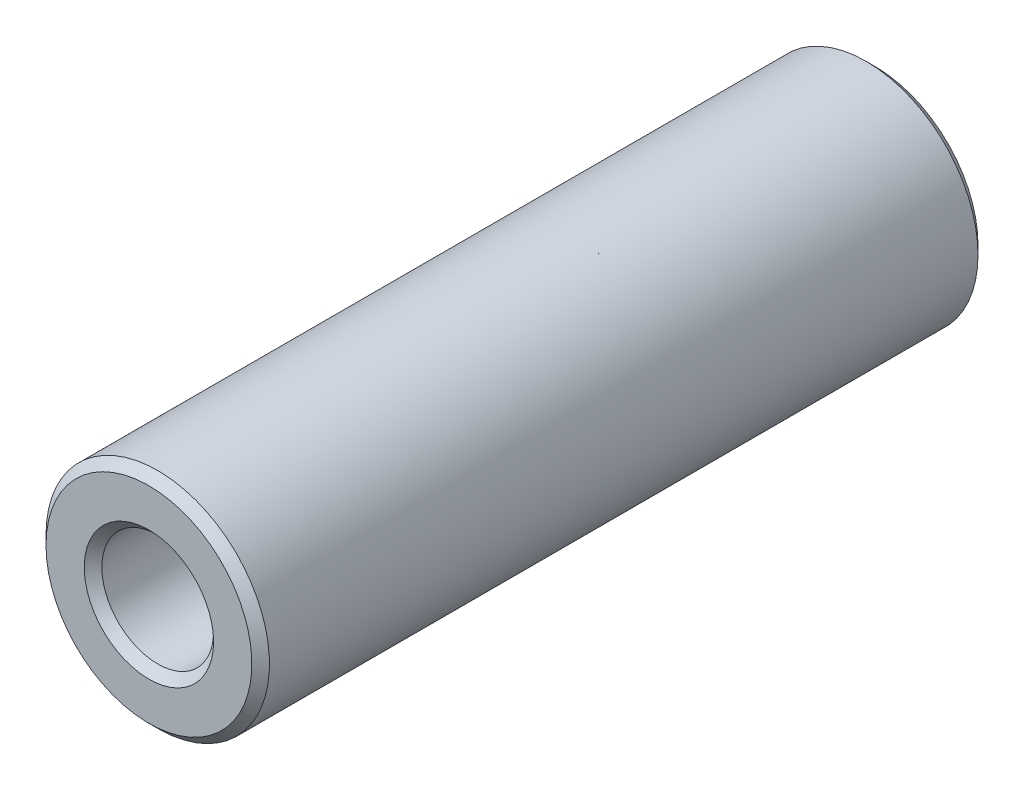
ISO-10303-21;
HEADER;
FILE_DESCRIPTION(('STEP AP214'),'2;1');
FILE_NAME('part.step','',(''),(''),'','','');
FILE_SCHEMA(('AUTOMOTIVE_DESIGN { 1 0 10303 214 1 1 1 1 }'));
ENDSEC;
DATA;
#1=APPLICATION_CONTEXT('core data for automotive mechanical design processes');
#2=APPLICATION_PROTOCOL_DEFINITION('international standard','automotive_design',2000,#1);
#3=PRODUCT_CONTEXT('',#1,'mechanical');
#4=PRODUCT('Part','Part','',(#3));
#5=PRODUCT_RELATED_PRODUCT_CATEGORY('part','',(#4));
#6=PRODUCT_DEFINITION_FORMATION('','',#4);
#7=PRODUCT_DEFINITION_CONTEXT('part definition',#1,'design');
#8=PRODUCT_DEFINITION('design','',#6,#7);
#9=PRODUCT_DEFINITION_SHAPE('','',#8);
#10=(LENGTH_UNIT() NAMED_UNIT(*) SI_UNIT(.MILLI.,.METRE.));
#11=(NAMED_UNIT(*) PLANE_ANGLE_UNIT() SI_UNIT($,.RADIAN.));
#12=(NAMED_UNIT(*) SI_UNIT($,.STERADIAN.) SOLID_ANGLE_UNIT());
#13=UNCERTAINTY_MEASURE_WITH_UNIT(LENGTH_MEASURE(1.E-05),#10,'distance_accuracy_value','');
#14=(GEOMETRIC_REPRESENTATION_CONTEXT(3) GLOBAL_UNCERTAINTY_ASSIGNED_CONTEXT((#13)) GLOBAL_UNIT_ASSIGNED_CONTEXT((#10,
#11,#12)) REPRESENTATION_CONTEXT('',''));
#15=CARTESIAN_POINT('',(0.,0.,0.));
#16=DIRECTION('',(0.,0.,1.));
#17=DIRECTION('',(1.,0.,0.));
#18=AXIS2_PLACEMENT_3D('',#15,#16,#17);
#19=CARTESIAN_POINT('',(0.,0.,41.275));
#20=DIRECTION('',(0.,0.,-1.));
#21=DIRECTION('',(-1.,0.,0.));
#22=AXIS2_PLACEMENT_3D('',#19,#20,#21);
#23=CYLINDRICAL_SURFACE('',#22,3.175);
#24=CARTESIAN_POINT('',(0.,0.,0.499999999988177));
#25=DIRECTION('',(0.,0.,-1.));
#26=DIRECTION('',(-1.,0.,0.));
#27=AXIS2_PLACEMENT_3D('',#24,#25,#26);
#28=CIRCLE('',#27,3.17499999999882);
#29=CARTESIAN_POINT('',(-3.17499999999882,0.,0.499999999988177));
#30=VERTEX_POINT('',#29);
#31=EDGE_CURVE('E30',#30,#30,#28,.T.);
#32=ORIENTED_EDGE('',*,*,#31,.T.);
#33=EDGE_LOOP('',(#32));
#34=FACE_BOUND('',#33,.T.);
#35=CARTESIAN_POINT('',(0.,0.,40.7750000000533));
#36=DIRECTION('',(0.,0.,1.));
#37=DIRECTION('',(1.,0.,0.));
#38=AXIS2_PLACEMENT_3D('',#35,#36,#37);
#39=CIRCLE('',#38,3.17500000005566);
#40=CARTESIAN_POINT('',(3.17500000005566,0.,40.7750000000533));
#41=VERTEX_POINT('',#40);
#42=EDGE_CURVE('E33',#41,#41,#39,.T.);
#43=ORIENTED_EDGE('',*,*,#42,.T.);
#44=EDGE_LOOP('',(#43));
#45=FACE_BOUND('',#44,.T.);
#46=ADVANCED_FACE('F15',(#34,#45),#23,.F.);
#47=CARTESIAN_POINT('',(0.,0.,41.2749999999278));
#48=DIRECTION('',(0.,0.,1.));
#49=DIRECTION('',(1.,0.,0.));
#50=AXIS2_PLACEMENT_3D('',#47,#48,#49);
#51=CONICAL_SURFACE('',#50,3.67499999987331,0.785398163397448);
#52=ORIENTED_EDGE('',*,*,#42,.F.);
#53=EDGE_LOOP('',(#52));
#54=FACE_BOUND('',#53,.T.);
#55=CARTESIAN_POINT('',(0.,0.,41.2750000000415));
#56=DIRECTION('',(0.,0.,1.));
#57=DIRECTION('',(1.,0.,0.));
#58=AXIS2_PLACEMENT_3D('',#55,#56,#57);
#59=CIRCLE('',#58,3.67499999998699);
#60=CARTESIAN_POINT('',(3.67499999998699,0.,41.2750000000415));
#61=VERTEX_POINT('',#60);
#62=EDGE_CURVE('E18',#61,#61,#59,.F.);
#63=ORIENTED_EDGE('',*,*,#62,.F.);
#64=EDGE_LOOP('',(#63));
#65=FACE_BOUND('',#64,.T.);
#66=ADVANCED_FACE('F50',(#54,#65),#51,.F.);
#67=CARTESIAN_POINT('',(0.,0.,5.6843418860808E-11));
#68=DIRECTION('',(0.,0.,-1.));
#69=DIRECTION('',(-1.,0.,0.));
#70=AXIS2_PLACEMENT_3D('',#67,#68,#69);
#71=CONICAL_SURFACE('',#70,3.67499999987331,0.785398163340605);
#72=CARTESIAN_POINT('',(0.,0.,0.));
#73=DIRECTION('',(0.,0.,-1.));
#74=DIRECTION('',(-1.,0.,0.));
#75=AXIS2_PLACEMENT_3D('',#72,#73,#74);
#76=CIRCLE('',#75,3.67499999993015);
#77=CARTESIAN_POINT('',(-3.67499999993015,0.,0.));
#78=VERTEX_POINT('',#77);
#79=EDGE_CURVE('E40',#78,#78,#76,.T.);
#80=ORIENTED_EDGE('',*,*,#79,.T.);
#81=EDGE_LOOP('',(#80));
#82=FACE_BOUND('',#81,.T.);
#83=ORIENTED_EDGE('',*,*,#31,.F.);
#84=EDGE_LOOP('',(#83));
#85=FACE_BOUND('',#84,.T.);
#86=ADVANCED_FACE('F52',(#82,#85),#71,.F.);
#87=CARTESIAN_POINT('',(0.,0.,41.275));
#88=DIRECTION('',(0.,0.,1.));
#89=DIRECTION('',(1.,0.,0.));
#90=AXIS2_PLACEMENT_3D('',#87,#88,#89);
#91=PLANE('',#90);
#92=ORIENTED_EDGE('',*,*,#62,.T.);
#93=EDGE_LOOP('',(#92));
#94=FACE_BOUND('',#93,.T.);
#95=CARTESIAN_POINT('',(0.,0.,41.2750000000415));
#96=DIRECTION('',(0.,0.,-1.));
#97=DIRECTION('',(-1.,0.,0.));
#98=AXIS2_PLACEMENT_3D('',#95,#96,#97);
#99=CIRCLE('',#98,5.85000000000946);
#100=CARTESIAN_POINT('',(-5.85000000000946,0.,41.2750000000415));
#101=VERTEX_POINT('',#100);
#102=EDGE_CURVE('E38',#101,#101,#99,.T.);
#103=ORIENTED_EDGE('',*,*,#102,.F.);
#104=EDGE_LOOP('',(#103));
#105=FACE_BOUND('',#104,.T.);
#106=ADVANCED_FACE('F47',(#94,#105),#91,.T.);
#107=CARTESIAN_POINT('',(0.,0.,0.));
#108=DIRECTION('',(0.,0.,1.));
#109=DIRECTION('',(1.,0.,0.));
#110=AXIS2_PLACEMENT_3D('',#107,#108,#109);
#111=PLANE('',#110);
#112=CARTESIAN_POINT('',(0.,0.,-5.6843418860808E-11));
#113=DIRECTION('',(0.,0.,1.));
#114=DIRECTION('',(1.,0.,0.));
#115=AXIS2_PLACEMENT_3D('',#112,#113,#114);
#116=CIRCLE('',#115,5.84999999995262);
#117=CARTESIAN_POINT('',(5.84999999995262,0.,-5.6843418860808E-11));
#118=VERTEX_POINT('',#117);
#119=EDGE_CURVE('E27',#118,#118,#116,.T.);
#120=ORIENTED_EDGE('',*,*,#119,.F.);
#121=EDGE_LOOP('',(#120));
#122=FACE_BOUND('',#121,.T.);
#123=ORIENTED_EDGE('',*,*,#79,.F.);
#124=EDGE_LOOP('',(#123));
#125=FACE_BOUND('',#124,.T.);
#126=ADVANCED_FACE('F76',(#122,#125),#111,.F.);
#127=CARTESIAN_POINT('',(0.,0.,40.7749999999396));
#128=DIRECTION('',(0.,0.,-1.));
#129=DIRECTION('',(-1.,0.,0.));
#130=AXIS2_PLACEMENT_3D('',#127,#128,#129);
#131=CONICAL_SURFACE('',#130,6.35000000005448,0.785398163340605);
#132=CARTESIAN_POINT('',(0.,0.,40.775));
#133=DIRECTION('',(0.,0.,-1.));
#134=DIRECTION('',(-1.,0.,0.));
#135=AXIS2_PLACEMENT_3D('',#132,#133,#134);
#136=CIRCLE('',#135,6.35);
#137=CARTESIAN_POINT('',(-6.35,0.,40.775));
#138=VERTEX_POINT('',#137);
#139=EDGE_CURVE('E22',#138,#138,#136,.T.);
#140=ORIENTED_EDGE('',*,*,#139,.F.);
#141=EDGE_LOOP('',(#140));
#142=FACE_BOUND('',#141,.T.);
#143=ORIENTED_EDGE('',*,*,#102,.T.);
#144=EDGE_LOOP('',(#143));
#145=FACE_BOUND('',#144,.T.);
#146=ADVANCED_FACE('F69',(#142,#145),#131,.T.);
#147=CARTESIAN_POINT('',(0.,0.,0.499999999931333));
#148=DIRECTION('',(0.,0.,1.));
#149=DIRECTION('',(1.,0.,0.));
#150=AXIS2_PLACEMENT_3D('',#147,#148,#149);
#151=CONICAL_SURFACE('',#150,6.34999999999764,0.785398163454292);
#152=CARTESIAN_POINT('',(0.,0.,0.499999999999994));
#153=DIRECTION('',(0.,0.,-1.));
#154=DIRECTION('',(-1.,0.,0.));
#155=AXIS2_PLACEMENT_3D('',#152,#153,#154);
#156=CIRCLE('',#155,6.35);
#157=CARTESIAN_POINT('',(-6.35,0.,0.499999999999994));
#158=VERTEX_POINT('',#157);
#159=EDGE_CURVE('E10',#158,#158,#156,.F.);
#160=ORIENTED_EDGE('',*,*,#159,.F.);
#161=EDGE_LOOP('',(#160));
#162=FACE_BOUND('',#161,.T.);
#163=ORIENTED_EDGE('',*,*,#119,.T.);
#164=EDGE_LOOP('',(#163));
#165=FACE_BOUND('',#164,.T.);
#166=ADVANCED_FACE('F64',(#162,#165),#151,.T.);
#167=CARTESIAN_POINT('',(0.,0.,41.275));
#168=DIRECTION('',(0.,0.,-1.));
#169=DIRECTION('',(-1.,0.,0.));
#170=AXIS2_PLACEMENT_3D('',#167,#168,#169);
#171=CYLINDRICAL_SURFACE('',#170,6.35);
#172=ORIENTED_EDGE('',*,*,#159,.T.);
#173=EDGE_LOOP('',(#172));
#174=FACE_BOUND('',#173,.T.);
#175=ORIENTED_EDGE('',*,*,#139,.T.);
#176=EDGE_LOOP('',(#175));
#177=FACE_BOUND('',#176,.T.);
#178=ADVANCED_FACE('F62',(#174,#177),#171,.T.);
#179=CLOSED_SHELL('',(#46,#66,#86,#106,#126,#146,#166,#178));
#180=MANIFOLD_SOLID_BREP('B1',#179);
#181=ADVANCED_BREP_SHAPE_REPRESENTATION('',(#18,#180),#14);
#182=SHAPE_DEFINITION_REPRESENTATION(#9,#181);
ENDSEC;
END-ISO-10303-21;
